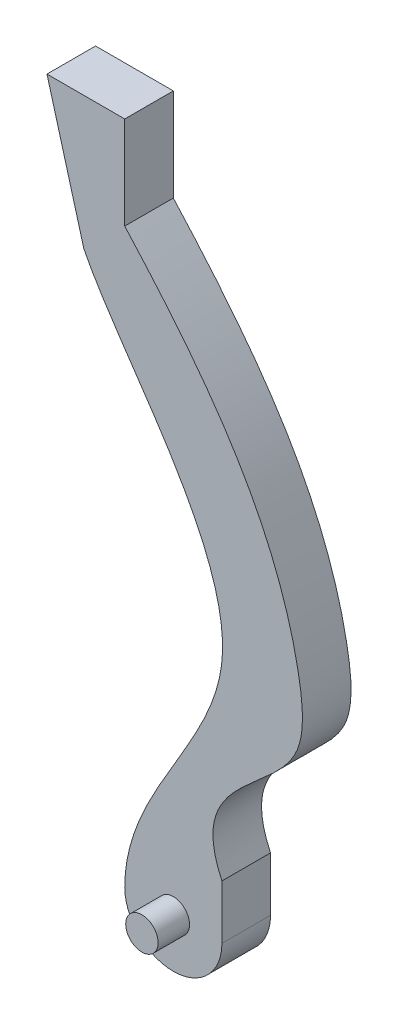
ISO-10303-21;
HEADER;
FILE_DESCRIPTION(('STEP AP214'),'2;1');
FILE_NAME('part.step','',(''),(''),'','','');
FILE_SCHEMA(('AUTOMOTIVE_DESIGN { 1 0 10303 214 1 1 1 1 }'));
ENDSEC;
DATA;
#1=APPLICATION_CONTEXT('core data for automotive mechanical design processes');
#2=APPLICATION_PROTOCOL_DEFINITION('international standard','automotive_design',2000,#1);
#3=PRODUCT_CONTEXT('',#1,'mechanical');
#4=PRODUCT('Part','Part','',(#3));
#5=PRODUCT_RELATED_PRODUCT_CATEGORY('part','',(#4));
#6=PRODUCT_DEFINITION_FORMATION('','',#4);
#7=PRODUCT_DEFINITION_CONTEXT('part definition',#1,'design');
#8=PRODUCT_DEFINITION('design','',#6,#7);
#9=PRODUCT_DEFINITION_SHAPE('','',#8);
#10=(LENGTH_UNIT() NAMED_UNIT(*) SI_UNIT(.MILLI.,.METRE.));
#11=(NAMED_UNIT(*) PLANE_ANGLE_UNIT() SI_UNIT($,.RADIAN.));
#12=(NAMED_UNIT(*) SI_UNIT($,.STERADIAN.) SOLID_ANGLE_UNIT());
#13=UNCERTAINTY_MEASURE_WITH_UNIT(LENGTH_MEASURE(1.E-05),#10,'distance_accuracy_value','');
#14=(GEOMETRIC_REPRESENTATION_CONTEXT(3) GLOBAL_UNCERTAINTY_ASSIGNED_CONTEXT((#13)) GLOBAL_UNIT_ASSIGNED_CONTEXT((#10,
#11,#12)) REPRESENTATION_CONTEXT('',''));
#15=CARTESIAN_POINT('',(0.,0.,0.));
#16=DIRECTION('',(0.,0.,1.));
#17=DIRECTION('',(1.,0.,0.));
#18=AXIS2_PLACEMENT_3D('',#15,#16,#17);
#19=CARTESIAN_POINT('',(0.,0.,7.5));
#20=DIRECTION('',(0.,0.,-1.));
#21=DIRECTION('',(-1.,0.,0.));
#22=AXIS2_PLACEMENT_3D('',#19,#20,#21);
#23=CYLINDRICAL_SURFACE('',#22,15.);
#24=CARTESIAN_POINT('',(0.,0.,-7.5));
#25=DIRECTION('',(0.,0.,1.));
#26=DIRECTION('',(-1.,0.,0.));
#27=AXIS2_PLACEMENT_3D('',#24,#25,#26);
#28=CIRCLE('',#27,15.);
#29=CARTESIAN_POINT('',(-15.,0.,-7.5));
#30=VERTEX_POINT('',#29);
#31=CARTESIAN_POINT('',(15.,0.,-7.5));
#32=VERTEX_POINT('',#31);
#33=EDGE_CURVE('E128',#30,#32,#28,.T.);
#34=ORIENTED_EDGE('',*,*,#33,.T.);
#35=DIRECTION('',(0.,0.,-1.));
#36=VECTOR('',#35,1.);
#37=CARTESIAN_POINT('',(15.,0.,7.5));
#38=LINE('',#37,#36);
#39=CARTESIAN_POINT('',(15.,0.,7.5));
#40=VERTEX_POINT('',#39);
#41=EDGE_CURVE('E41',#40,#32,#38,.T.);
#42=ORIENTED_EDGE('',*,*,#41,.F.);
#43=CARTESIAN_POINT('',(0.,0.,7.5));
#44=DIRECTION('',(0.,0.,1.));
#45=DIRECTION('',(-1.,0.,0.));
#46=AXIS2_PLACEMENT_3D('',#43,#44,#45);
#47=CIRCLE('',#46,15.);
#48=CARTESIAN_POINT('',(-15.,0.,7.5));
#49=VERTEX_POINT('',#48);
#50=EDGE_CURVE('E162',#49,#40,#47,.T.);
#51=ORIENTED_EDGE('',*,*,#50,.F.);
#52=DIRECTION('',(0.,0.,-1.));
#53=VECTOR('',#52,1.);
#54=CARTESIAN_POINT('',(-15.,0.,7.5));
#55=LINE('',#54,#53);
#56=EDGE_CURVE('E121',#49,#30,#55,.T.);
#57=ORIENTED_EDGE('',*,*,#56,.T.);
#58=EDGE_LOOP('',(#34,#42,#51,#57));
#59=FACE_BOUND('',#58,.T.);
#60=ADVANCED_FACE('F32',(#59),#23,.T.);
#61=CARTESIAN_POINT('',(15.,0.,7.5));
#62=DIRECTION('',(-1.,0.,0.));
#63=DIRECTION('',(0.,0.,1.));
#64=AXIS2_PLACEMENT_3D('',#61,#62,#63);
#65=PLANE('',#64);
#66=DIRECTION('',(0.,1.,0.));
#67=VECTOR('',#66,1.);
#68=CARTESIAN_POINT('',(15.,0.,-7.5));
#69=LINE('',#68,#67);
#70=CARTESIAN_POINT('',(15.,16.68,-7.5));
#71=VERTEX_POINT('',#70);
#72=EDGE_CURVE('E175',#32,#71,#69,.T.);
#73=ORIENTED_EDGE('',*,*,#72,.T.);
#74=DIRECTION('',(0.,0.,-1.));
#75=VECTOR('',#74,1.);
#76=CARTESIAN_POINT('',(15.,16.68,7.5));
#77=LINE('',#76,#75);
#78=CARTESIAN_POINT('',(15.,16.68,7.5));
#79=VERTEX_POINT('',#78);
#80=EDGE_CURVE('E204',#79,#71,#77,.T.);
#81=ORIENTED_EDGE('',*,*,#80,.F.);
#82=DIRECTION('',(0.,1.,0.));
#83=VECTOR('',#82,1.);
#84=CARTESIAN_POINT('',(15.,0.,7.5));
#85=LINE('',#84,#83);
#86=EDGE_CURVE('E91',#40,#79,#85,.T.);
#87=ORIENTED_EDGE('',*,*,#86,.F.);
#88=ORIENTED_EDGE('',*,*,#41,.T.);
#89=EDGE_LOOP('',(#73,#81,#87,#88));
#90=FACE_BOUND('',#89,.T.);
#91=ADVANCED_FACE('F151',(#90),#65,.F.);
#92=CARTESIAN_POINT('',(15.,16.68,7.5));
#93=CARTESIAN_POINT('',(3.45097257926161,41.2051695867704,7.5));
#94=CARTESIAN_POINT('',(42.5924493624835,50.1532610485417,7.5));
#95=CARTESIAN_POINT('',(36.1236430957064,115.709280279242,7.5));
#96=CARTESIAN_POINT('',(9.33557097857552,149.750442519324,7.5));
#97=CARTESIAN_POINT('',(-15.,176.722477056,7.5));
#98=B_SPLINE_CURVE_WITH_KNOTS('',3,(#92,#93,#94,#95,#96,#97),.UNSPECIFIED.,.F.,.F.,(4,1,1,4),
(0.,0.285986580853016,0.402946003015989,1.),.UNSPECIFIED.);
#99=DIRECTION('',(0.,0.,-1.));
#100=VECTOR('',#99,1.);
#101=SURFACE_OF_LINEAR_EXTRUSION('',#98,#100);
#102=CARTESIAN_POINT('',(15.,16.68,-7.5));
#103=CARTESIAN_POINT('',(3.45097257926161,41.2051695867704,-7.5));
#104=CARTESIAN_POINT('',(42.5924493624835,50.1532610485417,-7.5));
#105=CARTESIAN_POINT('',(36.1236430957064,115.709280279242,-7.5));
#106=CARTESIAN_POINT('',(9.33557097857552,149.750442519324,-7.5));
#107=CARTESIAN_POINT('',(-15.,176.722477056,-7.5));
#108=B_SPLINE_CURVE_WITH_KNOTS('',3,(#102,#103,#104,#105,#106,#107),.UNSPECIFIED.,.F.,.F.,(4,1,
1,4),(0.,0.285986580853016,0.402946003015989,1.),.UNSPECIFIED.);
#109=CARTESIAN_POINT('',(-15.,176.722477056,-7.5));
#110=VERTEX_POINT('',#109);
#111=EDGE_CURVE('E179',#71,#110,#108,.T.);
#112=ORIENTED_EDGE('',*,*,#111,.T.);
#113=DIRECTION('',(0.,0.,-1.));
#114=VECTOR('',#113,1.);
#115=CARTESIAN_POINT('',(-15.,176.722477056,7.5));
#116=LINE('',#115,#114);
#117=CARTESIAN_POINT('',(-15.,176.722477056,7.5));
#118=VERTEX_POINT('',#117);
#119=EDGE_CURVE('E201',#118,#110,#116,.T.);
#120=ORIENTED_EDGE('',*,*,#119,.F.);
#121=EDGE_CURVE('E153',#79,#118,#98,.T.);
#122=ORIENTED_EDGE('',*,*,#121,.F.);
#123=ORIENTED_EDGE('',*,*,#80,.T.);
#124=EDGE_LOOP('',(#112,#120,#122,#123));
#125=FACE_BOUND('',#124,.T.);
#126=ADVANCED_FACE('F147',(#125),#101,.F.);
#127=CARTESIAN_POINT('',(-15.,176.722477056,7.5));
#128=DIRECTION('',(-1.,0.,0.));
#129=DIRECTION('',(0.,0.,1.));
#130=AXIS2_PLACEMENT_3D('',#127,#128,#129);
#131=PLANE('',#130);
#132=DIRECTION('',(0.,1.,0.));
#133=VECTOR('',#132,1.);
#134=CARTESIAN_POINT('',(-15.,176.722477056,-7.5));
#135=LINE('',#134,#133);
#136=CARTESIAN_POINT('',(-15.,205.366233563424,-7.5));
#137=VERTEX_POINT('',#136);
#138=EDGE_CURVE('E181',#110,#137,#135,.T.);
#139=ORIENTED_EDGE('',*,*,#138,.T.);
#140=DIRECTION('',(0.,0.,-1.));
#141=VECTOR('',#140,1.);
#142=CARTESIAN_POINT('',(-15.,205.366233563424,7.5));
#143=LINE('',#142,#141);
#144=CARTESIAN_POINT('',(-15.,205.366233563424,7.5));
#145=VERTEX_POINT('',#144);
#146=EDGE_CURVE('E116',#145,#137,#143,.T.);
#147=ORIENTED_EDGE('',*,*,#146,.F.);
#148=DIRECTION('',(0.,1.,0.));
#149=VECTOR('',#148,1.);
#150=CARTESIAN_POINT('',(-15.,176.722477056,7.5));
#151=LINE('',#150,#149);
#152=EDGE_CURVE('E107',#118,#145,#151,.T.);
#153=ORIENTED_EDGE('',*,*,#152,.F.);
#154=ORIENTED_EDGE('',*,*,#119,.T.);
#155=EDGE_LOOP('',(#139,#147,#153,#154));
#156=FACE_BOUND('',#155,.T.);
#157=ADVANCED_FACE('F144',(#156),#131,.F.);
#158=CARTESIAN_POINT('',(-15.,205.366233563424,7.5));
#159=DIRECTION('',(0.,-1.,0.));
#160=DIRECTION('',(0.,0.,-1.));
#161=AXIS2_PLACEMENT_3D('',#158,#159,#160);
#162=PLANE('',#161);
#163=DIRECTION('',(-1.,0.,0.));
#164=VECTOR('',#163,1.);
#165=CARTESIAN_POINT('',(-15.,205.366233563424,-7.5));
#166=LINE('',#165,#164);
#167=CARTESIAN_POINT('',(-39.0029474653453,205.366233563424,-7.5));
#168=VERTEX_POINT('',#167);
#169=EDGE_CURVE('E115',#137,#168,#166,.T.);
#170=ORIENTED_EDGE('',*,*,#169,.T.);
#171=DIRECTION('',(0.,0.,-1.));
#172=VECTOR('',#171,1.);
#173=CARTESIAN_POINT('',(-39.0029474653453,205.366233563424,7.5));
#174=LINE('',#173,#172);
#175=CARTESIAN_POINT('',(-39.0029474653453,205.366233563424,7.5));
#176=VERTEX_POINT('',#175);
#177=EDGE_CURVE('E112',#176,#168,#174,.T.);
#178=ORIENTED_EDGE('',*,*,#177,.F.);
#179=DIRECTION('',(-1.,0.,0.));
#180=VECTOR('',#179,1.);
#181=CARTESIAN_POINT('',(-15.,205.366233563424,7.5));
#182=LINE('',#181,#180);
#183=EDGE_CURVE('E101',#145,#176,#182,.T.);
#184=ORIENTED_EDGE('',*,*,#183,.F.);
#185=ORIENTED_EDGE('',*,*,#146,.T.);
#186=EDGE_LOOP('',(#170,#178,#184,#185));
#187=FACE_BOUND('',#186,.T.);
#188=ADVANCED_FACE('F113',(#187),#162,.F.);
#189=CARTESIAN_POINT('',(-39.0029474653453,205.366233563424,7.5));
#190=DIRECTION('',(0.963573353521571,0.267444185547552,0.));
#191=DIRECTION('',(-0.267444185547552,0.963573353521571,0.));
#192=AXIS2_PLACEMENT_3D('',#189,#190,#191);
#193=PLANE('',#192);
#194=DIRECTION('',(0.267444185547552,-0.963573353521571,0.));
#195=VECTOR('',#194,1.);
#196=CARTESIAN_POINT('',(-39.0029474653453,205.366233563424,-7.5));
#197=LINE('',#196,#195);
#198=CARTESIAN_POINT('',(-27.6186899180146,164.349947493207,-7.5));
#199=VERTEX_POINT('',#198);
#200=EDGE_CURVE('E76',#168,#199,#197,.T.);
#201=ORIENTED_EDGE('',*,*,#200,.T.);
#202=DIRECTION('',(0.,0.,-1.));
#203=VECTOR('',#202,1.);
#204=CARTESIAN_POINT('',(-27.6186899180146,164.349947493207,7.5));
#205=LINE('',#204,#203);
#206=CARTESIAN_POINT('',(-27.6186899180146,164.349947493207,7.5));
#207=VERTEX_POINT('',#206);
#208=EDGE_CURVE('E117',#207,#199,#205,.T.);
#209=ORIENTED_EDGE('',*,*,#208,.F.);
#210=DIRECTION('',(0.267444185547552,-0.963573353521571,0.));
#211=VECTOR('',#210,1.);
#212=CARTESIAN_POINT('',(-39.0029474653453,205.366233563424,7.5));
#213=LINE('',#212,#211);
#214=EDGE_CURVE('E105',#176,#207,#213,.T.);
#215=ORIENTED_EDGE('',*,*,#214,.F.);
#216=ORIENTED_EDGE('',*,*,#177,.T.);
#217=EDGE_LOOP('',(#201,#209,#215,#216));
#218=FACE_BOUND('',#217,.T.);
#219=ADVANCED_FACE('F119',(#218),#193,.F.);
#220=CARTESIAN_POINT('',(-27.6186899180146,164.349947493207,7.5));
#221=CARTESIAN_POINT('',(-15.9615444837975,140.960070013465,7.5));
#222=CARTESIAN_POINT('',(45.9092566261704,77.6002278181429,7.5));
#223=CARTESIAN_POINT('',(-14.8655774709612,27.6560752094001,7.5));
#224=CARTESIAN_POINT('',(-15.,0.,7.5));
#225=B_SPLINE_CURVE_WITH_KNOTS('',3,(#220,#221,#222,#223,#224),.UNSPECIFIED.,.F.,.F.,(4,1,4),
(0.,0.549643328931235,1.),.UNSPECIFIED.);
#226=DIRECTION('',(0.,0.,-1.));
#227=VECTOR('',#226,1.);
#228=SURFACE_OF_LINEAR_EXTRUSION('',#225,#227);
#229=CARTESIAN_POINT('',(-27.6186899180146,164.349947493207,-7.5));
#230=CARTESIAN_POINT('',(-15.9615444837975,140.960070013465,-7.5));
#231=CARTESIAN_POINT('',(45.9092566261704,77.6002278181429,-7.5));
#232=CARTESIAN_POINT('',(-14.8655774709612,27.6560752094001,-7.5));
#233=CARTESIAN_POINT('',(-15.,0.,-7.5));
#234=B_SPLINE_CURVE_WITH_KNOTS('',3,(#229,#230,#231,#232,#233),.UNSPECIFIED.,.F.,.F.,(4,1,4),
(0.,0.549643328931235,1.),.UNSPECIFIED.);
#235=EDGE_CURVE('E82',#199,#30,#234,.T.);
#236=ORIENTED_EDGE('',*,*,#235,.T.);
#237=ORIENTED_EDGE('',*,*,#56,.F.);
#238=EDGE_CURVE('E50',#207,#49,#225,.T.);
#239=ORIENTED_EDGE('',*,*,#238,.F.);
#240=ORIENTED_EDGE('',*,*,#208,.T.);
#241=EDGE_LOOP('',(#236,#237,#239,#240));
#242=FACE_BOUND('',#241,.T.);
#243=ADVANCED_FACE('F134',(#242),#228,.F.);
#244=CARTESIAN_POINT('',(0.,0.,7.5));
#245=DIRECTION('',(0.,0.,-1.));
#246=DIRECTION('',(-1.,0.,0.));
#247=AXIS2_PLACEMENT_3D('',#244,#245,#246);
#248=PLANE('',#247);
#249=CARTESIAN_POINT('',(0.,0.,7.5));
#250=DIRECTION('',(0.,0.,-1.));
#251=DIRECTION('',(-1.,0.,0.));
#252=AXIS2_PLACEMENT_3D('',#249,#250,#251);
#253=CIRCLE('',#252,5.);
#254=CARTESIAN_POINT('',(-5.,0.,7.5));
#255=VERTEX_POINT('',#254);
#256=EDGE_CURVE('E11',#255,#255,#253,.F.);
#257=ORIENTED_EDGE('',*,*,#256,.F.);
#258=EDGE_LOOP('',(#257));
#259=FACE_BOUND('',#258,.T.);
#260=ORIENTED_EDGE('',*,*,#50,.T.);
#261=ORIENTED_EDGE('',*,*,#86,.T.);
#262=ORIENTED_EDGE('',*,*,#121,.T.);
#263=ORIENTED_EDGE('',*,*,#152,.T.);
#264=ORIENTED_EDGE('',*,*,#183,.T.);
#265=ORIENTED_EDGE('',*,*,#214,.T.);
#266=ORIENTED_EDGE('',*,*,#238,.T.);
#267=EDGE_LOOP('',(#260,#261,#262,#263,#264,#265,#266));
#268=FACE_BOUND('',#267,.T.);
#269=ADVANCED_FACE('F103',(#259,#268),#248,.F.);
#270=CARTESIAN_POINT('',(0.,0.,-7.5));
#271=DIRECTION('',(0.,0.,-1.));
#272=DIRECTION('',(-1.,0.,0.));
#273=AXIS2_PLACEMENT_3D('',#270,#271,#272);
#274=PLANE('',#273);
#275=CARTESIAN_POINT('',(0.,0.,-7.5));
#276=DIRECTION('',(0.,0.,-1.));
#277=DIRECTION('',(-1.,0.,0.));
#278=AXIS2_PLACEMENT_3D('',#275,#276,#277);
#279=CIRCLE('',#278,5.);
#280=CARTESIAN_POINT('',(-5.,0.,-7.5));
#281=VERTEX_POINT('',#280);
#282=EDGE_CURVE('E35',#281,#281,#279,.F.);
#283=ORIENTED_EDGE('',*,*,#282,.T.);
#284=EDGE_LOOP('',(#283));
#285=FACE_BOUND('',#284,.T.);
#286=ORIENTED_EDGE('',*,*,#33,.F.);
#287=ORIENTED_EDGE('',*,*,#235,.F.);
#288=ORIENTED_EDGE('',*,*,#200,.F.);
#289=ORIENTED_EDGE('',*,*,#169,.F.);
#290=ORIENTED_EDGE('',*,*,#138,.F.);
#291=ORIENTED_EDGE('',*,*,#111,.F.);
#292=ORIENTED_EDGE('',*,*,#72,.F.);
#293=EDGE_LOOP('',(#286,#287,#288,#289,#290,#291,#292));
#294=FACE_BOUND('',#293,.T.);
#295=ADVANCED_FACE('F138',(#285,#294),#274,.T.);
#296=CARTESIAN_POINT('',(0.,0.,-17.2));
#297=DIRECTION('',(0.,0.,1.));
#298=DIRECTION('',(1.,0.,0.));
#299=AXIS2_PLACEMENT_3D('',#296,#297,#298);
#300=PLANE('',#299);
#301=CARTESIAN_POINT('',(0.,0.,-17.2));
#302=DIRECTION('',(0.,0.,1.));
#303=DIRECTION('',(1.,0.,0.));
#304=AXIS2_PLACEMENT_3D('',#301,#302,#303);
#305=CIRCLE('',#304,5.);
#306=CARTESIAN_POINT('',(5.,0.,-17.2));
#307=VERTEX_POINT('',#306);
#308=EDGE_CURVE('E164',#307,#307,#305,.T.);
#309=ORIENTED_EDGE('',*,*,#308,.F.);
#310=EDGE_LOOP('',(#309));
#311=FACE_BOUND('',#310,.T.);
#312=ADVANCED_FACE('F212',(#311),#300,.F.);
#313=CARTESIAN_POINT('',(0.,0.,17.2));
#314=DIRECTION('',(0.,0.,-1.));
#315=DIRECTION('',(-1.,0.,0.));
#316=AXIS2_PLACEMENT_3D('',#313,#314,#315);
#317=CYLINDRICAL_SURFACE('',#316,5.);
#318=ORIENTED_EDGE('',*,*,#282,.F.);
#319=EDGE_LOOP('',(#318));
#320=FACE_BOUND('',#319,.T.);
#321=ORIENTED_EDGE('',*,*,#308,.T.);
#322=EDGE_LOOP('',(#321));
#323=FACE_BOUND('',#322,.T.);
#324=ADVANCED_FACE('F217',(#320,#323),#317,.T.);
#325=CARTESIAN_POINT('',(0.,0.,17.2));
#326=DIRECTION('',(0.,0.,1.));
#327=DIRECTION('',(1.,0.,0.));
#328=AXIS2_PLACEMENT_3D('',#325,#326,#327);
#329=CIRCLE('',#328,5.);
#330=CARTESIAN_POINT('',(5.,0.,17.2));
#331=VERTEX_POINT('',#330);
#332=EDGE_CURVE('E167',#331,#331,#329,.T.);
#333=ORIENTED_EDGE('',*,*,#332,.F.);
#334=EDGE_LOOP('',(#333));
#335=FACE_BOUND('',#334,.T.);
#336=ORIENTED_EDGE('',*,*,#256,.T.);
#337=EDGE_LOOP('',(#336));
#338=FACE_BOUND('',#337,.T.);
#339=ADVANCED_FACE('F270',(#335,#338),#317,.T.);
#340=CARTESIAN_POINT('',(0.,0.,17.2));
#341=DIRECTION('',(0.,0.,1.));
#342=DIRECTION('',(1.,0.,0.));
#343=AXIS2_PLACEMENT_3D('',#340,#341,#342);
#344=PLANE('',#343);
#345=ORIENTED_EDGE('',*,*,#332,.T.);
#346=EDGE_LOOP('',(#345));
#347=FACE_BOUND('',#346,.T.);
#348=ADVANCED_FACE('F280',(#347),#344,.T.);
#349=CLOSED_SHELL('',(#60,#91,#126,#157,#188,#219,#243,#269,#295,#312,#324,#339,#348));
#350=MANIFOLD_SOLID_BREP('B2',#349);
#351=ADVANCED_BREP_SHAPE_REPRESENTATION('',(#18,#350),#14);
#352=SHAPE_DEFINITION_REPRESENTATION(#9,#351);
ENDSEC;
END-ISO-10303-21;
